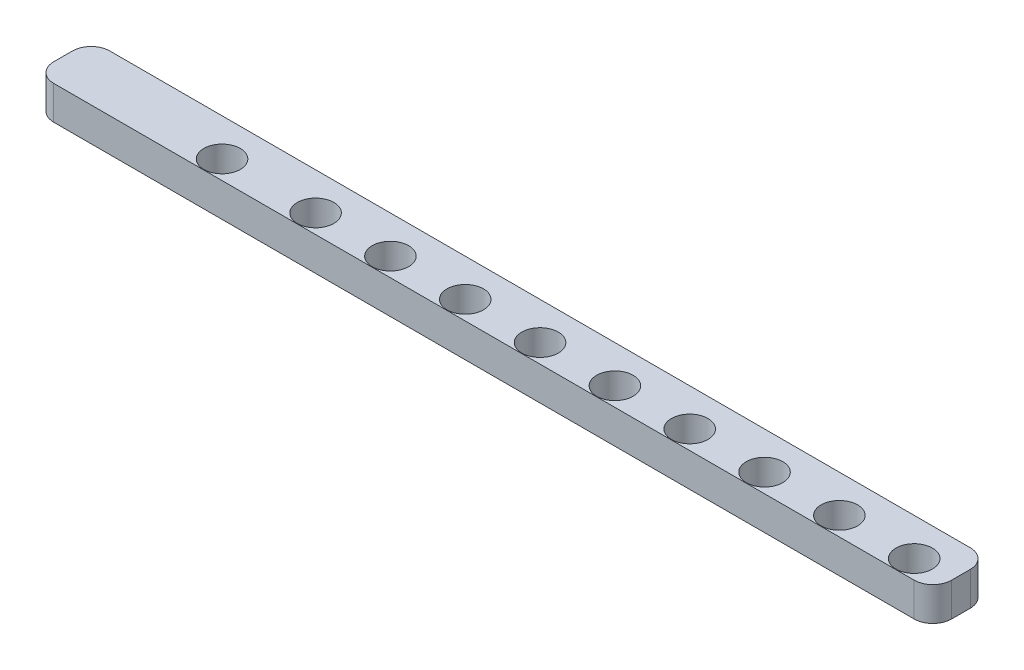
ISO-10303-21;
HEADER;
FILE_DESCRIPTION(('STEP AP214'),'2;1');
FILE_NAME('part.step','',(''),(''),'','','');
FILE_SCHEMA(('AUTOMOTIVE_DESIGN { 1 0 10303 214 1 1 1 1 }'));
ENDSEC;
DATA;
#1=APPLICATION_CONTEXT('core data for automotive mechanical design processes');
#2=APPLICATION_PROTOCOL_DEFINITION('international standard','automotive_design',2000,#1);
#3=PRODUCT_CONTEXT('',#1,'mechanical');
#4=PRODUCT('Part','Part','',(#3));
#5=PRODUCT_RELATED_PRODUCT_CATEGORY('part','',(#4));
#6=PRODUCT_DEFINITION_FORMATION('','',#4);
#7=PRODUCT_DEFINITION_CONTEXT('part definition',#1,'design');
#8=PRODUCT_DEFINITION('design','',#6,#7);
#9=PRODUCT_DEFINITION_SHAPE('','',#8);
#10=(LENGTH_UNIT() NAMED_UNIT(*) SI_UNIT(.MILLI.,.METRE.));
#11=(NAMED_UNIT(*) PLANE_ANGLE_UNIT() SI_UNIT($,.RADIAN.));
#12=(NAMED_UNIT(*) SI_UNIT($,.STERADIAN.) SOLID_ANGLE_UNIT());
#13=UNCERTAINTY_MEASURE_WITH_UNIT(LENGTH_MEASURE(1.E-05),#10,'distance_accuracy_value','');
#14=(GEOMETRIC_REPRESENTATION_CONTEXT(3) GLOBAL_UNCERTAINTY_ASSIGNED_CONTEXT((#13)) GLOBAL_UNIT_ASSIGNED_CONTEXT((#10,
#11,#12)) REPRESENTATION_CONTEXT('',''));
#15=CARTESIAN_POINT('',(0.,0.,0.));
#16=DIRECTION('',(0.,0.,1.));
#17=DIRECTION('',(1.,0.,0.));
#18=AXIS2_PLACEMENT_3D('',#15,#16,#17);
#19=CARTESIAN_POINT('',(94.,3.6,4.));
#20=DIRECTION('',(0.,-1.,0.));
#21=DIRECTION('',(0.,0.,-1.));
#22=AXIS2_PLACEMENT_3D('',#19,#20,#21);
#23=CYLINDRICAL_SURFACE('',#22,2.);
#24=CARTESIAN_POINT('',(94.,0.,4.));
#25=DIRECTION('',(0.,1.,0.));
#26=DIRECTION('',(0.,0.,1.));
#27=AXIS2_PLACEMENT_3D('',#24,#25,#26);
#28=CIRCLE('',#27,2.);
#29=CARTESIAN_POINT('',(94.,0.,6.));
#30=VERTEX_POINT('',#29);
#31=CARTESIAN_POINT('',(96.,0.,4.));
#32=VERTEX_POINT('',#31);
#33=EDGE_CURVE('E129',#30,#32,#28,.T.);
#34=ORIENTED_EDGE('',*,*,#33,.T.);
#35=DIRECTION('',(0.,-1.,0.));
#36=VECTOR('',#35,1.);
#37=CARTESIAN_POINT('',(96.,3.6,4.));
#38=LINE('',#37,#36);
#39=CARTESIAN_POINT('',(96.,3.6,4.));
#40=VERTEX_POINT('',#39);
#41=EDGE_CURVE('E11',#40,#32,#38,.T.);
#42=ORIENTED_EDGE('',*,*,#41,.F.);
#43=CARTESIAN_POINT('',(94.,3.6,4.));
#44=DIRECTION('',(0.,1.,0.));
#45=DIRECTION('',(0.,0.,1.));
#46=AXIS2_PLACEMENT_3D('',#43,#44,#45);
#47=CIRCLE('',#46,2.);
#48=CARTESIAN_POINT('',(94.,3.6,6.));
#49=VERTEX_POINT('',#48);
#50=EDGE_CURVE('E144',#49,#40,#47,.T.);
#51=ORIENTED_EDGE('',*,*,#50,.F.);
#52=DIRECTION('',(0.,-1.,0.));
#53=VECTOR('',#52,1.);
#54=CARTESIAN_POINT('',(94.,3.6,6.));
#55=LINE('',#54,#53);
#56=EDGE_CURVE('E125',#49,#30,#55,.T.);
#57=ORIENTED_EDGE('',*,*,#56,.T.);
#58=EDGE_LOOP('',(#34,#42,#51,#57));
#59=FACE_BOUND('',#58,.T.);
#60=ADVANCED_FACE('F33',(#59),#23,.T.);
#61=CARTESIAN_POINT('',(96.,3.6,2.));
#62=DIRECTION('',(-1.,0.,0.));
#63=DIRECTION('',(0.,0.,1.));
#64=AXIS2_PLACEMENT_3D('',#61,#62,#63);
#65=PLANE('',#64);
#66=DIRECTION('',(0.,0.,-1.));
#67=VECTOR('',#66,1.);
#68=CARTESIAN_POINT('',(96.,0.,2.));
#69=LINE('',#68,#67);
#70=CARTESIAN_POINT('',(96.,0.,2.));
#71=VERTEX_POINT('',#70);
#72=EDGE_CURVE('E132',#32,#71,#69,.T.);
#73=ORIENTED_EDGE('',*,*,#72,.T.);
#74=DIRECTION('',(0.,-1.,0.));
#75=VECTOR('',#74,1.);
#76=CARTESIAN_POINT('',(96.,3.6,2.));
#77=LINE('',#76,#75);
#78=CARTESIAN_POINT('',(96.,3.6,2.));
#79=VERTEX_POINT('',#78);
#80=EDGE_CURVE('E41',#79,#71,#77,.T.);
#81=ORIENTED_EDGE('',*,*,#80,.F.);
#82=DIRECTION('',(0.,0.,-1.));
#83=VECTOR('',#82,1.);
#84=CARTESIAN_POINT('',(96.,3.6,2.));
#85=LINE('',#84,#83);
#86=EDGE_CURVE('E92',#40,#79,#85,.T.);
#87=ORIENTED_EDGE('',*,*,#86,.F.);
#88=ORIENTED_EDGE('',*,*,#41,.T.);
#89=EDGE_LOOP('',(#73,#81,#87,#88));
#90=FACE_BOUND('',#89,.T.);
#91=ADVANCED_FACE('F284',(#90),#65,.F.);
#92=CARTESIAN_POINT('',(94.,3.6,2.));
#93=DIRECTION('',(0.,-1.,0.));
#94=DIRECTION('',(0.,0.,-1.));
#95=AXIS2_PLACEMENT_3D('',#92,#93,#94);
#96=CYLINDRICAL_SURFACE('',#95,2.);
#97=CARTESIAN_POINT('',(94.,0.,2.));
#98=DIRECTION('',(0.,1.,0.));
#99=DIRECTION('',(0.,0.,-1.));
#100=AXIS2_PLACEMENT_3D('',#97,#98,#99);
#101=CIRCLE('',#100,2.);
#102=CARTESIAN_POINT('',(94.,0.,0.));
#103=VERTEX_POINT('',#102);
#104=EDGE_CURVE('E135',#71,#103,#101,.T.);
#105=ORIENTED_EDGE('',*,*,#104,.T.);
#106=DIRECTION('',(0.,-1.,0.));
#107=VECTOR('',#106,1.);
#108=CARTESIAN_POINT('',(94.,3.6,0.));
#109=LINE('',#108,#107);
#110=CARTESIAN_POINT('',(94.,3.6,0.));
#111=VERTEX_POINT('',#110);
#112=EDGE_CURVE('E151',#111,#103,#109,.T.);
#113=ORIENTED_EDGE('',*,*,#112,.F.);
#114=CARTESIAN_POINT('',(94.,3.6,2.));
#115=DIRECTION('',(0.,1.,0.));
#116=DIRECTION('',(0.,0.,-1.));
#117=AXIS2_PLACEMENT_3D('',#114,#115,#116);
#118=CIRCLE('',#117,2.);
#119=EDGE_CURVE('E159',#79,#111,#118,.T.);
#120=ORIENTED_EDGE('',*,*,#119,.F.);
#121=ORIENTED_EDGE('',*,*,#80,.T.);
#122=EDGE_LOOP('',(#105,#113,#120,#121));
#123=FACE_BOUND('',#122,.T.);
#124=ADVANCED_FACE('F157',(#123),#96,.T.);
#125=CARTESIAN_POINT('',(2.00000000000001,3.6,0.));
#126=DIRECTION('',(0.,0.,1.));
#127=DIRECTION('',(1.,0.,0.));
#128=AXIS2_PLACEMENT_3D('',#125,#126,#127);
#129=PLANE('',#128);
#130=DIRECTION('',(-1.,0.,0.));
#131=VECTOR('',#130,1.);
#132=CARTESIAN_POINT('',(2.00000000000001,0.,0.));
#133=LINE('',#132,#131);
#134=CARTESIAN_POINT('',(2.00000000000001,0.,0.));
#135=VERTEX_POINT('',#134);
#136=EDGE_CURVE('E137',#103,#135,#133,.T.);
#137=ORIENTED_EDGE('',*,*,#136,.T.);
#138=DIRECTION('',(0.,-1.,0.));
#139=VECTOR('',#138,1.);
#140=CARTESIAN_POINT('',(2.00000000000001,3.6,0.));
#141=LINE('',#140,#139);
#142=CARTESIAN_POINT('',(2.00000000000001,3.6,0.));
#143=VERTEX_POINT('',#142);
#144=EDGE_CURVE('E148',#143,#135,#141,.T.);
#145=ORIENTED_EDGE('',*,*,#144,.F.);
#146=DIRECTION('',(-1.,0.,0.));
#147=VECTOR('',#146,1.);
#148=CARTESIAN_POINT('',(2.00000000000001,3.6,0.));
#149=LINE('',#148,#147);
#150=EDGE_CURVE('E171',#111,#143,#149,.T.);
#151=ORIENTED_EDGE('',*,*,#150,.F.);
#152=ORIENTED_EDGE('',*,*,#112,.T.);
#153=EDGE_LOOP('',(#137,#145,#151,#152));
#154=FACE_BOUND('',#153,.T.);
#155=ADVANCED_FACE('F167',(#154),#129,.F.);
#156=CARTESIAN_POINT('',(2.,3.6,2.));
#157=DIRECTION('',(0.,-1.,0.));
#158=DIRECTION('',(0.,0.,-1.));
#159=AXIS2_PLACEMENT_3D('',#156,#157,#158);
#160=CYLINDRICAL_SURFACE('',#159,2.);
#161=CARTESIAN_POINT('',(2.,0.,2.));
#162=DIRECTION('',(0.,1.,0.));
#163=DIRECTION('',(0.,0.,1.));
#164=AXIS2_PLACEMENT_3D('',#161,#162,#163);
#165=CIRCLE('',#164,2.);
#166=CARTESIAN_POINT('',(0.,0.,2.00000000000001));
#167=VERTEX_POINT('',#166);
#168=EDGE_CURVE('E139',#135,#167,#165,.T.);
#169=ORIENTED_EDGE('',*,*,#168,.T.);
#170=DIRECTION('',(0.,-1.,0.));
#171=VECTOR('',#170,1.);
#172=CARTESIAN_POINT('',(0.,3.6,2.00000000000001));
#173=LINE('',#172,#171);
#174=CARTESIAN_POINT('',(0.,3.6,2.00000000000001));
#175=VERTEX_POINT('',#174);
#176=EDGE_CURVE('E120',#175,#167,#173,.T.);
#177=ORIENTED_EDGE('',*,*,#176,.F.);
#178=CARTESIAN_POINT('',(2.,3.6,2.));
#179=DIRECTION('',(0.,1.,0.));
#180=DIRECTION('',(0.,0.,1.));
#181=AXIS2_PLACEMENT_3D('',#178,#179,#180);
#182=CIRCLE('',#181,2.);
#183=EDGE_CURVE('E111',#143,#175,#182,.T.);
#184=ORIENTED_EDGE('',*,*,#183,.F.);
#185=ORIENTED_EDGE('',*,*,#144,.T.);
#186=EDGE_LOOP('',(#169,#177,#184,#185));
#187=FACE_BOUND('',#186,.T.);
#188=ADVANCED_FACE('F170',(#187),#160,.T.);
#189=CARTESIAN_POINT('',(0.,3.6,2.00000000000001));
#190=DIRECTION('',(1.,0.,0.));
#191=DIRECTION('',(0.,0.,-1.));
#192=AXIS2_PLACEMENT_3D('',#189,#190,#191);
#193=PLANE('',#192);
#194=DIRECTION('',(0.,0.,1.));
#195=VECTOR('',#194,1.);
#196=CARTESIAN_POINT('',(0.,0.,2.00000000000001));
#197=LINE('',#196,#195);
#198=CARTESIAN_POINT('',(0.,0.,4.));
#199=VERTEX_POINT('',#198);
#200=EDGE_CURVE('E119',#167,#199,#197,.T.);
#201=ORIENTED_EDGE('',*,*,#200,.T.);
#202=DIRECTION('',(0.,-1.,0.));
#203=VECTOR('',#202,1.);
#204=CARTESIAN_POINT('',(0.,3.6,4.));
#205=LINE('',#204,#203);
#206=CARTESIAN_POINT('',(0.,3.6,4.));
#207=VERTEX_POINT('',#206);
#208=EDGE_CURVE('E116',#207,#199,#205,.T.);
#209=ORIENTED_EDGE('',*,*,#208,.F.);
#210=DIRECTION('',(0.,0.,1.));
#211=VECTOR('',#210,1.);
#212=CARTESIAN_POINT('',(0.,3.6,2.00000000000001));
#213=LINE('',#212,#211);
#214=EDGE_CURVE('E105',#175,#207,#213,.T.);
#215=ORIENTED_EDGE('',*,*,#214,.F.);
#216=ORIENTED_EDGE('',*,*,#176,.T.);
#217=EDGE_LOOP('',(#201,#209,#215,#216));
#218=FACE_BOUND('',#217,.T.);
#219=ADVANCED_FACE('F117',(#218),#193,.F.);
#220=CARTESIAN_POINT('',(2.,3.6,4.));
#221=DIRECTION('',(0.,-1.,0.));
#222=DIRECTION('',(0.,0.,-1.));
#223=AXIS2_PLACEMENT_3D('',#220,#221,#222);
#224=CYLINDRICAL_SURFACE('',#223,2.);
#225=CARTESIAN_POINT('',(2.,0.,4.));
#226=DIRECTION('',(0.,1.,0.));
#227=DIRECTION('',(0.,0.,1.));
#228=AXIS2_PLACEMENT_3D('',#225,#226,#227);
#229=CIRCLE('',#228,2.);
#230=CARTESIAN_POINT('',(2.,0.,6.));
#231=VERTEX_POINT('',#230);
#232=EDGE_CURVE('E78',#199,#231,#229,.T.);
#233=ORIENTED_EDGE('',*,*,#232,.T.);
#234=DIRECTION('',(0.,-1.,0.));
#235=VECTOR('',#234,1.);
#236=CARTESIAN_POINT('',(2.,3.6,6.));
#237=LINE('',#236,#235);
#238=CARTESIAN_POINT('',(2.,3.6,6.));
#239=VERTEX_POINT('',#238);
#240=EDGE_CURVE('E121',#239,#231,#237,.T.);
#241=ORIENTED_EDGE('',*,*,#240,.F.);
#242=CARTESIAN_POINT('',(2.,3.6,4.));
#243=DIRECTION('',(0.,1.,0.));
#244=DIRECTION('',(0.,0.,1.));
#245=AXIS2_PLACEMENT_3D('',#242,#243,#244);
#246=CIRCLE('',#245,2.);
#247=EDGE_CURVE('E109',#207,#239,#246,.T.);
#248=ORIENTED_EDGE('',*,*,#247,.F.);
#249=ORIENTED_EDGE('',*,*,#208,.T.);
#250=EDGE_LOOP('',(#233,#241,#248,#249));
#251=FACE_BOUND('',#250,.T.);
#252=ADVANCED_FACE('F123',(#251),#224,.T.);
#253=CARTESIAN_POINT('',(2.,3.6,6.));
#254=DIRECTION('',(0.,0.,-1.));
#255=DIRECTION('',(-1.,0.,0.));
#256=AXIS2_PLACEMENT_3D('',#253,#254,#255);
#257=PLANE('',#256);
#258=DIRECTION('',(1.,0.,0.));
#259=VECTOR('',#258,1.);
#260=CARTESIAN_POINT('',(2.,0.,6.));
#261=LINE('',#260,#259);
#262=EDGE_CURVE('E84',#231,#30,#261,.T.);
#263=ORIENTED_EDGE('',*,*,#262,.T.);
#264=ORIENTED_EDGE('',*,*,#56,.F.);
#265=DIRECTION('',(1.,0.,0.));
#266=VECTOR('',#265,1.);
#267=CARTESIAN_POINT('',(2.,3.6,6.));
#268=LINE('',#267,#266);
#269=EDGE_CURVE('E49',#239,#49,#268,.T.);
#270=ORIENTED_EDGE('',*,*,#269,.F.);
#271=ORIENTED_EDGE('',*,*,#240,.T.);
#272=EDGE_LOOP('',(#263,#264,#270,#271));
#273=FACE_BOUND('',#272,.T.);
#274=ADVANCED_FACE('F248',(#273),#257,.F.);
#275=CARTESIAN_POINT('',(94.,3.6,4.));
#276=DIRECTION('',(0.,1.,0.));
#277=DIRECTION('',(0.,0.,1.));
#278=AXIS2_PLACEMENT_3D('',#275,#276,#277);
#279=PLANE('',#278);
#280=CARTESIAN_POINT('',(92.,3.6,4.));
#281=DIRECTION('',(0.,1.,0.));
#282=DIRECTION('',(0.,0.,1.));
#283=AXIS2_PLACEMENT_3D('',#280,#281,#282);
#284=CIRCLE('',#283,1.95);
#285=CARTESIAN_POINT('',(92.,3.6,5.95));
#286=VERTEX_POINT('',#285);
#287=EDGE_CURVE('E190',#286,#286,#284,.T.);
#288=ORIENTED_EDGE('',*,*,#287,.F.);
#289=EDGE_LOOP('',(#288));
#290=FACE_BOUND('',#289,.T.);
#291=CARTESIAN_POINT('',(76.,3.6,4.));
#292=DIRECTION('',(0.,1.,0.));
#293=DIRECTION('',(0.,0.,1.));
#294=AXIS2_PLACEMENT_3D('',#291,#292,#293);
#295=CIRCLE('',#294,1.95);
#296=CARTESIAN_POINT('',(76.,3.6,5.95));
#297=VERTEX_POINT('',#296);
#298=EDGE_CURVE('E227',#297,#297,#295,.T.);
#299=ORIENTED_EDGE('',*,*,#298,.F.);
#300=EDGE_LOOP('',(#299));
#301=FACE_BOUND('',#300,.T.);
#302=CARTESIAN_POINT('',(36.,3.6,4.00000000000001));
#303=DIRECTION('',(0.,1.,0.));
#304=DIRECTION('',(0.,0.,1.));
#305=AXIS2_PLACEMENT_3D('',#302,#303,#304);
#306=CIRCLE('',#305,1.95);
#307=CARTESIAN_POINT('',(36.,3.6,5.95000000000001));
#308=VERTEX_POINT('',#307);
#309=EDGE_CURVE('E191',#308,#308,#306,.T.);
#310=ORIENTED_EDGE('',*,*,#309,.F.);
#311=EDGE_LOOP('',(#310));
#312=FACE_BOUND('',#311,.T.);
#313=CARTESIAN_POINT('',(28.,3.6,4.00000000000001));
#314=DIRECTION('',(0.,1.,0.));
#315=DIRECTION('',(0.,0.,1.));
#316=AXIS2_PLACEMENT_3D('',#313,#314,#315);
#317=CIRCLE('',#316,1.95);
#318=CARTESIAN_POINT('',(28.,3.6,5.95000000000001));
#319=VERTEX_POINT('',#318);
#320=EDGE_CURVE('E198',#319,#319,#317,.T.);
#321=ORIENTED_EDGE('',*,*,#320,.F.);
#322=EDGE_LOOP('',(#321));
#323=FACE_BOUND('',#322,.T.);
#324=CARTESIAN_POINT('',(18.,3.6,4.00000000000001));
#325=DIRECTION('',(0.,1.,0.));
#326=DIRECTION('',(0.,0.,1.));
#327=AXIS2_PLACEMENT_3D('',#324,#325,#326);
#328=CIRCLE('',#327,1.95);
#329=CARTESIAN_POINT('',(18.,3.6,5.95000000000001));
#330=VERTEX_POINT('',#329);
#331=EDGE_CURVE('E177',#330,#330,#328,.T.);
#332=ORIENTED_EDGE('',*,*,#331,.F.);
#333=EDGE_LOOP('',(#332));
#334=FACE_BOUND('',#333,.T.);
#335=CARTESIAN_POINT('',(84.,3.6,4.));
#336=DIRECTION('',(0.,1.,0.));
#337=DIRECTION('',(0.,0.,1.));
#338=AXIS2_PLACEMENT_3D('',#335,#336,#337);
#339=CIRCLE('',#338,1.95);
#340=CARTESIAN_POINT('',(84.,3.6,5.95));
#341=VERTEX_POINT('',#340);
#342=EDGE_CURVE('E184',#341,#341,#339,.T.);
#343=ORIENTED_EDGE('',*,*,#342,.F.);
#344=EDGE_LOOP('',(#343));
#345=FACE_BOUND('',#344,.T.);
#346=CARTESIAN_POINT('',(44.,3.6,4.00000000000001));
#347=DIRECTION('',(0.,1.,0.));
#348=DIRECTION('',(0.,0.,1.));
#349=AXIS2_PLACEMENT_3D('',#346,#347,#348);
#350=CIRCLE('',#349,1.95);
#351=CARTESIAN_POINT('',(44.,3.6,5.95000000000001));
#352=VERTEX_POINT('',#351);
#353=EDGE_CURVE('E222',#352,#352,#350,.T.);
#354=ORIENTED_EDGE('',*,*,#353,.F.);
#355=EDGE_LOOP('',(#354));
#356=FACE_BOUND('',#355,.T.);
#357=CARTESIAN_POINT('',(52.,3.6,4.));
#358=DIRECTION('',(0.,1.,0.));
#359=DIRECTION('',(0.,0.,1.));
#360=AXIS2_PLACEMENT_3D('',#357,#358,#359);
#361=CIRCLE('',#360,1.95);
#362=CARTESIAN_POINT('',(52.,3.6,5.95));
#363=VERTEX_POINT('',#362);
#364=EDGE_CURVE('E216',#363,#363,#361,.T.);
#365=ORIENTED_EDGE('',*,*,#364,.F.);
#366=EDGE_LOOP('',(#365));
#367=FACE_BOUND('',#366,.T.);
#368=CARTESIAN_POINT('',(60.,3.6,4.));
#369=DIRECTION('',(0.,1.,0.));
#370=DIRECTION('',(0.,0.,1.));
#371=AXIS2_PLACEMENT_3D('',#368,#369,#370);
#372=CIRCLE('',#371,1.95);
#373=CARTESIAN_POINT('',(60.,3.6,5.95));
#374=VERTEX_POINT('',#373);
#375=EDGE_CURVE('E210',#374,#374,#372,.T.);
#376=ORIENTED_EDGE('',*,*,#375,.F.);
#377=EDGE_LOOP('',(#376));
#378=FACE_BOUND('',#377,.T.);
#379=CARTESIAN_POINT('',(68.,3.6,4.));
#380=DIRECTION('',(0.,1.,0.));
#381=DIRECTION('',(0.,0.,1.));
#382=AXIS2_PLACEMENT_3D('',#379,#380,#381);
#383=CIRCLE('',#382,1.95000000000001);
#384=CARTESIAN_POINT('',(68.,3.6,5.95000000000002));
#385=VERTEX_POINT('',#384);
#386=EDGE_CURVE('E203',#385,#385,#383,.T.);
#387=ORIENTED_EDGE('',*,*,#386,.F.);
#388=EDGE_LOOP('',(#387));
#389=FACE_BOUND('',#388,.T.);
#390=ORIENTED_EDGE('',*,*,#50,.T.);
#391=ORIENTED_EDGE('',*,*,#86,.T.);
#392=ORIENTED_EDGE('',*,*,#119,.T.);
#393=ORIENTED_EDGE('',*,*,#150,.T.);
#394=ORIENTED_EDGE('',*,*,#183,.T.);
#395=ORIENTED_EDGE('',*,*,#214,.T.);
#396=ORIENTED_EDGE('',*,*,#247,.T.);
#397=ORIENTED_EDGE('',*,*,#269,.T.);
#398=EDGE_LOOP('',(#390,#391,#392,#393,#394,#395,#396,#397));
#399=FACE_BOUND('',#398,.T.);
#400=ADVANCED_FACE('F107',(#290,#301,#312,#323,#334,#345,#356,#367,#378,#389,#399),#279,.T.);
#401=CARTESIAN_POINT('',(94.,0.,4.));
#402=DIRECTION('',(0.,1.,0.));
#403=DIRECTION('',(0.,0.,1.));
#404=AXIS2_PLACEMENT_3D('',#401,#402,#403);
#405=PLANE('',#404);
#406=CARTESIAN_POINT('',(92.,0.,4.));
#407=DIRECTION('',(0.,1.,0.));
#408=DIRECTION('',(0.,0.,1.));
#409=AXIS2_PLACEMENT_3D('',#406,#407,#408);
#410=CIRCLE('',#409,1.95);
#411=CARTESIAN_POINT('',(92.,0.,5.95));
#412=VERTEX_POINT('',#411);
#413=EDGE_CURVE('E133',#412,#412,#410,.T.);
#414=ORIENTED_EDGE('',*,*,#413,.T.);
#415=EDGE_LOOP('',(#414));
#416=FACE_BOUND('',#415,.T.);
#417=CARTESIAN_POINT('',(76.,0.,4.));
#418=DIRECTION('',(0.,1.,0.));
#419=DIRECTION('',(0.,0.,1.));
#420=AXIS2_PLACEMENT_3D('',#417,#418,#419);
#421=CIRCLE('',#420,1.95);
#422=CARTESIAN_POINT('',(76.,0.,5.95));
#423=VERTEX_POINT('',#422);
#424=EDGE_CURVE('E207',#423,#423,#421,.T.);
#425=ORIENTED_EDGE('',*,*,#424,.T.);
#426=EDGE_LOOP('',(#425));
#427=FACE_BOUND('',#426,.T.);
#428=CARTESIAN_POINT('',(36.,0.,4.00000000000001));
#429=DIRECTION('',(0.,1.,0.));
#430=DIRECTION('',(0.,0.,1.));
#431=AXIS2_PLACEMENT_3D('',#428,#429,#430);
#432=CIRCLE('',#431,1.95);
#433=CARTESIAN_POINT('',(36.,0.,5.95000000000001));
#434=VERTEX_POINT('',#433);
#435=EDGE_CURVE('E194',#434,#434,#432,.T.);
#436=ORIENTED_EDGE('',*,*,#435,.T.);
#437=EDGE_LOOP('',(#436));
#438=FACE_BOUND('',#437,.T.);
#439=CARTESIAN_POINT('',(28.,0.,4.00000000000001));
#440=DIRECTION('',(0.,1.,0.));
#441=DIRECTION('',(0.,0.,1.));
#442=AXIS2_PLACEMENT_3D('',#439,#440,#441);
#443=CIRCLE('',#442,1.95);
#444=CARTESIAN_POINT('',(28.,0.,5.95000000000001));
#445=VERTEX_POINT('',#444);
#446=EDGE_CURVE('E181',#445,#445,#443,.T.);
#447=ORIENTED_EDGE('',*,*,#446,.T.);
#448=EDGE_LOOP('',(#447));
#449=FACE_BOUND('',#448,.T.);
#450=CARTESIAN_POINT('',(18.,0.,4.00000000000001));
#451=DIRECTION('',(0.,1.,0.));
#452=DIRECTION('',(0.,0.,1.));
#453=AXIS2_PLACEMENT_3D('',#450,#451,#452);
#454=CIRCLE('',#453,1.95);
#455=CARTESIAN_POINT('',(18.,0.,5.95000000000001));
#456=VERTEX_POINT('',#455);
#457=EDGE_CURVE('E180',#456,#456,#454,.T.);
#458=ORIENTED_EDGE('',*,*,#457,.T.);
#459=EDGE_LOOP('',(#458));
#460=FACE_BOUND('',#459,.T.);
#461=CARTESIAN_POINT('',(84.,0.,4.));
#462=DIRECTION('',(0.,1.,0.));
#463=DIRECTION('',(0.,0.,1.));
#464=AXIS2_PLACEMENT_3D('',#461,#462,#463);
#465=CIRCLE('',#464,1.95);
#466=CARTESIAN_POINT('',(84.,0.,5.95));
#467=VERTEX_POINT('',#466);
#468=EDGE_CURVE('E187',#467,#467,#465,.T.);
#469=ORIENTED_EDGE('',*,*,#468,.T.);
#470=EDGE_LOOP('',(#469));
#471=FACE_BOUND('',#470,.T.);
#472=CARTESIAN_POINT('',(44.,0.,4.00000000000001));
#473=DIRECTION('',(0.,1.,0.));
#474=DIRECTION('',(0.,0.,1.));
#475=AXIS2_PLACEMENT_3D('',#472,#473,#474);
#476=CIRCLE('',#475,1.95);
#477=CARTESIAN_POINT('',(44.,0.,5.95000000000001));
#478=VERTEX_POINT('',#477);
#479=EDGE_CURVE('E195',#478,#478,#476,.T.);
#480=ORIENTED_EDGE('',*,*,#479,.T.);
#481=EDGE_LOOP('',(#480));
#482=FACE_BOUND('',#481,.T.);
#483=CARTESIAN_POINT('',(52.,0.,4.));
#484=DIRECTION('',(0.,1.,0.));
#485=DIRECTION('',(0.,0.,1.));
#486=AXIS2_PLACEMENT_3D('',#483,#484,#485);
#487=CIRCLE('',#486,1.95);
#488=CARTESIAN_POINT('',(52.,0.,5.95));
#489=VERTEX_POINT('',#488);
#490=EDGE_CURVE('E219',#489,#489,#487,.T.);
#491=ORIENTED_EDGE('',*,*,#490,.T.);
#492=EDGE_LOOP('',(#491));
#493=FACE_BOUND('',#492,.T.);
#494=CARTESIAN_POINT('',(60.,0.,4.));
#495=DIRECTION('',(0.,1.,0.));
#496=DIRECTION('',(0.,0.,1.));
#497=AXIS2_PLACEMENT_3D('',#494,#495,#496);
#498=CIRCLE('',#497,1.95);
#499=CARTESIAN_POINT('',(60.,0.,5.95));
#500=VERTEX_POINT('',#499);
#501=EDGE_CURVE('E213',#500,#500,#498,.T.);
#502=ORIENTED_EDGE('',*,*,#501,.T.);
#503=EDGE_LOOP('',(#502));
#504=FACE_BOUND('',#503,.T.);
#505=CARTESIAN_POINT('',(68.,0.,4.));
#506=DIRECTION('',(0.,1.,0.));
#507=DIRECTION('',(0.,0.,1.));
#508=AXIS2_PLACEMENT_3D('',#505,#506,#507);
#509=CIRCLE('',#508,1.95000000000001);
#510=CARTESIAN_POINT('',(68.,0.,5.95000000000002));
#511=VERTEX_POINT('',#510);
#512=EDGE_CURVE('E206',#511,#511,#509,.T.);
#513=ORIENTED_EDGE('',*,*,#512,.T.);
#514=EDGE_LOOP('',(#513));
#515=FACE_BOUND('',#514,.T.);
#516=ORIENTED_EDGE('',*,*,#33,.F.);
#517=ORIENTED_EDGE('',*,*,#262,.F.);
#518=ORIENTED_EDGE('',*,*,#232,.F.);
#519=ORIENTED_EDGE('',*,*,#200,.F.);
#520=ORIENTED_EDGE('',*,*,#168,.F.);
#521=ORIENTED_EDGE('',*,*,#136,.F.);
#522=ORIENTED_EDGE('',*,*,#104,.F.);
#523=ORIENTED_EDGE('',*,*,#72,.F.);
#524=EDGE_LOOP('',(#516,#517,#518,#519,#520,#521,#522,#523));
#525=FACE_BOUND('',#524,.T.);
#526=ADVANCED_FACE('F163',(#416,#427,#438,#449,#460,#471,#482,#493,#504,#515,#525),#405,.F.);
#527=CARTESIAN_POINT('',(68.,0.,4.));
#528=DIRECTION('',(0.,1.,0.));
#529=DIRECTION('',(0.,0.,1.));
#530=AXIS2_PLACEMENT_3D('',#527,#528,#529);
#531=CYLINDRICAL_SURFACE('',#530,1.95000000000001);
#532=ORIENTED_EDGE('',*,*,#512,.F.);
#533=EDGE_LOOP('',(#532));
#534=FACE_BOUND('',#533,.T.);
#535=ORIENTED_EDGE('',*,*,#386,.T.);
#536=EDGE_LOOP('',(#535));
#537=FACE_BOUND('',#536,.T.);
#538=ADVANCED_FACE('F268',(#534,#537),#531,.F.);
#539=CARTESIAN_POINT('',(60.,0.,4.));
#540=DIRECTION('',(0.,1.,0.));
#541=DIRECTION('',(0.,0.,1.));
#542=AXIS2_PLACEMENT_3D('',#539,#540,#541);
#543=CYLINDRICAL_SURFACE('',#542,1.95);
#544=ORIENTED_EDGE('',*,*,#501,.F.);
#545=EDGE_LOOP('',(#544));
#546=FACE_BOUND('',#545,.T.);
#547=ORIENTED_EDGE('',*,*,#375,.T.);
#548=EDGE_LOOP('',(#547));
#549=FACE_BOUND('',#548,.T.);
#550=ADVANCED_FACE('F270',(#546,#549),#543,.F.);
#551=CARTESIAN_POINT('',(52.,0.,4.));
#552=DIRECTION('',(0.,1.,0.));
#553=DIRECTION('',(0.,0.,1.));
#554=AXIS2_PLACEMENT_3D('',#551,#552,#553);
#555=CYLINDRICAL_SURFACE('',#554,1.95);
#556=ORIENTED_EDGE('',*,*,#490,.F.);
#557=EDGE_LOOP('',(#556));
#558=FACE_BOUND('',#557,.T.);
#559=ORIENTED_EDGE('',*,*,#364,.T.);
#560=EDGE_LOOP('',(#559));
#561=FACE_BOUND('',#560,.T.);
#562=ADVANCED_FACE('F277',(#558,#561),#555,.F.);
#563=CARTESIAN_POINT('',(44.,0.,4.00000000000001));
#564=DIRECTION('',(0.,1.,0.));
#565=DIRECTION('',(0.,0.,1.));
#566=AXIS2_PLACEMENT_3D('',#563,#564,#565);
#567=CYLINDRICAL_SURFACE('',#566,1.95);
#568=ORIENTED_EDGE('',*,*,#479,.F.);
#569=EDGE_LOOP('',(#568));
#570=FACE_BOUND('',#569,.T.);
#571=ORIENTED_EDGE('',*,*,#353,.T.);
#572=EDGE_LOOP('',(#571));
#573=FACE_BOUND('',#572,.T.);
#574=ADVANCED_FACE('F360',(#570,#573),#567,.F.);
#575=CARTESIAN_POINT('',(84.,0.,4.));
#576=DIRECTION('',(0.,1.,0.));
#577=DIRECTION('',(0.,0.,1.));
#578=AXIS2_PLACEMENT_3D('',#575,#576,#577);
#579=CYLINDRICAL_SURFACE('',#578,1.95);
#580=ORIENTED_EDGE('',*,*,#468,.F.);
#581=EDGE_LOOP('',(#580));
#582=FACE_BOUND('',#581,.T.);
#583=ORIENTED_EDGE('',*,*,#342,.T.);
#584=EDGE_LOOP('',(#583));
#585=FACE_BOUND('',#584,.T.);
#586=ADVANCED_FACE('F370',(#582,#585),#579,.F.);
#587=CARTESIAN_POINT('',(18.,0.,4.00000000000001));
#588=DIRECTION('',(0.,1.,0.));
#589=DIRECTION('',(0.,0.,1.));
#590=AXIS2_PLACEMENT_3D('',#587,#588,#589);
#591=CYLINDRICAL_SURFACE('',#590,1.95);
#592=ORIENTED_EDGE('',*,*,#457,.F.);
#593=EDGE_LOOP('',(#592));
#594=FACE_BOUND('',#593,.T.);
#595=ORIENTED_EDGE('',*,*,#331,.T.);
#596=EDGE_LOOP('',(#595));
#597=FACE_BOUND('',#596,.T.);
#598=ADVANCED_FACE('F380',(#594,#597),#591,.F.);
#599=CARTESIAN_POINT('',(28.,0.,4.00000000000001));
#600=DIRECTION('',(0.,1.,0.));
#601=DIRECTION('',(0.,0.,1.));
#602=AXIS2_PLACEMENT_3D('',#599,#600,#601);
#603=CYLINDRICAL_SURFACE('',#602,1.95);
#604=ORIENTED_EDGE('',*,*,#446,.F.);
#605=EDGE_LOOP('',(#604));
#606=FACE_BOUND('',#605,.T.);
#607=ORIENTED_EDGE('',*,*,#320,.T.);
#608=EDGE_LOOP('',(#607));
#609=FACE_BOUND('',#608,.T.);
#610=ADVANCED_FACE('F390',(#606,#609),#603,.F.);
#611=CARTESIAN_POINT('',(36.,0.,4.00000000000001));
#612=DIRECTION('',(0.,1.,0.));
#613=DIRECTION('',(0.,0.,1.));
#614=AXIS2_PLACEMENT_3D('',#611,#612,#613);
#615=CYLINDRICAL_SURFACE('',#614,1.95);
#616=ORIENTED_EDGE('',*,*,#435,.F.);
#617=EDGE_LOOP('',(#616));
#618=FACE_BOUND('',#617,.T.);
#619=ORIENTED_EDGE('',*,*,#309,.T.);
#620=EDGE_LOOP('',(#619));
#621=FACE_BOUND('',#620,.T.);
#622=ADVANCED_FACE('F400',(#618,#621),#615,.F.);
#623=CARTESIAN_POINT('',(76.,0.,4.));
#624=DIRECTION('',(0.,1.,0.));
#625=DIRECTION('',(0.,0.,1.));
#626=AXIS2_PLACEMENT_3D('',#623,#624,#625);
#627=CYLINDRICAL_SURFACE('',#626,1.95);
#628=ORIENTED_EDGE('',*,*,#424,.F.);
#629=EDGE_LOOP('',(#628));
#630=FACE_BOUND('',#629,.T.);
#631=ORIENTED_EDGE('',*,*,#298,.T.);
#632=EDGE_LOOP('',(#631));
#633=FACE_BOUND('',#632,.T.);
#634=ADVANCED_FACE('F242',(#630,#633),#627,.F.);
#635=CARTESIAN_POINT('',(92.,0.,4.));
#636=DIRECTION('',(0.,1.,0.));
#637=DIRECTION('',(0.,0.,1.));
#638=AXIS2_PLACEMENT_3D('',#635,#636,#637);
#639=CYLINDRICAL_SURFACE('',#638,1.95);
#640=ORIENTED_EDGE('',*,*,#413,.F.);
#641=EDGE_LOOP('',(#640));
#642=FACE_BOUND('',#641,.T.);
#643=ORIENTED_EDGE('',*,*,#287,.T.);
#644=EDGE_LOOP('',(#643));
#645=FACE_BOUND('',#644,.T.);
#646=ADVANCED_FACE('F239',(#642,#645),#639,.F.);
#647=CLOSED_SHELL('',(#60,#91,#124,#155,#188,#219,#252,#274,#400,#526,#538,#550,#562,#574,#586,
#598,#610,#622,#634,#646));
#648=MANIFOLD_SOLID_BREP('B2',#647);
#649=ADVANCED_BREP_SHAPE_REPRESENTATION('',(#18,#648),#14);
#650=SHAPE_DEFINITION_REPRESENTATION(#9,#649);
ENDSEC;
END-ISO-10303-21;
